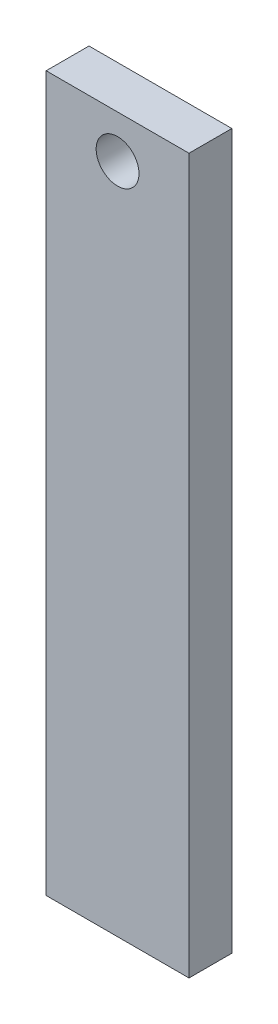
ISO-10303-21;
HEADER;
FILE_DESCRIPTION(('STEP AP214'),'2;1');
FILE_NAME('part.step','',(''),(''),'','','');
FILE_SCHEMA(('AUTOMOTIVE_DESIGN { 1 0 10303 214 1 1 1 1 }'));
ENDSEC;
DATA;
#1=APPLICATION_CONTEXT('core data for automotive mechanical design processes');
#2=APPLICATION_PROTOCOL_DEFINITION('international standard','automotive_design',2000,#1);
#3=PRODUCT_CONTEXT('',#1,'mechanical');
#4=PRODUCT('Part','Part','',(#3));
#5=PRODUCT_RELATED_PRODUCT_CATEGORY('part','',(#4));
#6=PRODUCT_DEFINITION_FORMATION('','',#4);
#7=PRODUCT_DEFINITION_CONTEXT('part definition',#1,'design');
#8=PRODUCT_DEFINITION('design','',#6,#7);
#9=PRODUCT_DEFINITION_SHAPE('','',#8);
#10=(LENGTH_UNIT() NAMED_UNIT(*) SI_UNIT(.MILLI.,.METRE.));
#11=(NAMED_UNIT(*) PLANE_ANGLE_UNIT() SI_UNIT($,.RADIAN.));
#12=(NAMED_UNIT(*) SI_UNIT($,.STERADIAN.) SOLID_ANGLE_UNIT());
#13=UNCERTAINTY_MEASURE_WITH_UNIT(LENGTH_MEASURE(1.E-05),#10,'distance_accuracy_value','');
#14=(GEOMETRIC_REPRESENTATION_CONTEXT(3) GLOBAL_UNCERTAINTY_ASSIGNED_CONTEXT((#13)) GLOBAL_UNIT_ASSIGNED_CONTEXT((#10,
#11,#12)) REPRESENTATION_CONTEXT('',''));
#15=CARTESIAN_POINT('',(0.,0.,0.));
#16=DIRECTION('',(0.,0.,1.));
#17=DIRECTION('',(1.,0.,0.));
#18=AXIS2_PLACEMENT_3D('',#15,#16,#17);
#19=CARTESIAN_POINT('',(25.,250.,-7.5));
#20=DIRECTION('',(-1.,0.,0.));
#21=DIRECTION('',(0.,0.,1.));
#22=AXIS2_PLACEMENT_3D('',#19,#20,#21);
#23=PLANE('',#22);
#24=DIRECTION('',(0.,0.,-1.));
#25=VECTOR('',#24,1.);
#26=CARTESIAN_POINT('',(25.,0.,-7.5));
#27=LINE('',#26,#25);
#28=CARTESIAN_POINT('',(25.,0.,7.5));
#29=VERTEX_POINT('',#28);
#30=CARTESIAN_POINT('',(25.,0.,-7.5));
#31=VERTEX_POINT('',#30);
#32=EDGE_CURVE('E96',#29,#31,#27,.T.);
#33=ORIENTED_EDGE('',*,*,#32,.T.);
#34=DIRECTION('',(0.,-1.,0.));
#35=VECTOR('',#34,1.);
#36=CARTESIAN_POINT('',(25.,250.,-7.5));
#37=LINE('',#36,#35);
#38=CARTESIAN_POINT('',(25.,250.,-7.5));
#39=VERTEX_POINT('',#38);
#40=EDGE_CURVE('E11',#39,#31,#37,.T.);
#41=ORIENTED_EDGE('',*,*,#40,.F.);
#42=DIRECTION('',(0.,0.,-1.));
#43=VECTOR('',#42,1.);
#44=CARTESIAN_POINT('',(25.,250.,-7.5));
#45=LINE('',#44,#43);
#46=CARTESIAN_POINT('',(25.,250.,7.5));
#47=VERTEX_POINT('',#46);
#48=EDGE_CURVE('E84',#47,#39,#45,.T.);
#49=ORIENTED_EDGE('',*,*,#48,.F.);
#50=DIRECTION('',(0.,-1.,0.));
#51=VECTOR('',#50,1.);
#52=CARTESIAN_POINT('',(25.,250.,7.5));
#53=LINE('',#52,#51);
#54=EDGE_CURVE('E92',#47,#29,#53,.T.);
#55=ORIENTED_EDGE('',*,*,#54,.T.);
#56=EDGE_LOOP('',(#33,#41,#49,#55));
#57=FACE_BOUND('',#56,.T.);
#58=ADVANCED_FACE('F33',(#57),#23,.F.);
#59=CARTESIAN_POINT('',(-25.,250.,-7.5));
#60=DIRECTION('',(0.,0.,1.));
#61=DIRECTION('',(1.,0.,0.));
#62=AXIS2_PLACEMENT_3D('',#59,#60,#61);
#63=PLANE('',#62);
#64=CARTESIAN_POINT('',(0.,235.049185274442,-7.5));
#65=DIRECTION('',(0.,0.,1.));
#66=DIRECTION('',(1.,0.,0.));
#67=AXIS2_PLACEMENT_3D('',#64,#65,#66);
#68=CIRCLE('',#67,7.5);
#69=CARTESIAN_POINT('',(7.50000000000001,235.049185274442,-7.5));
#70=VERTEX_POINT('',#69);
#71=EDGE_CURVE('E99',#70,#70,#68,.T.);
#72=ORIENTED_EDGE('',*,*,#71,.T.);
#73=EDGE_LOOP('',(#72));
#74=FACE_BOUND('',#73,.T.);
#75=DIRECTION('',(-1.,0.,0.));
#76=VECTOR('',#75,1.);
#77=CARTESIAN_POINT('',(-25.,0.,-7.5));
#78=LINE('',#77,#76);
#79=CARTESIAN_POINT('',(-25.,0.,-7.5));
#80=VERTEX_POINT('',#79);
#81=EDGE_CURVE('E88',#31,#80,#78,.T.);
#82=ORIENTED_EDGE('',*,*,#81,.T.);
#83=DIRECTION('',(0.,-1.,0.));
#84=VECTOR('',#83,1.);
#85=CARTESIAN_POINT('',(-25.,250.,-7.5));
#86=LINE('',#85,#84);
#87=CARTESIAN_POINT('',(-25.,250.,-7.5));
#88=VERTEX_POINT('',#87);
#89=EDGE_CURVE('E41',#88,#80,#86,.T.);
#90=ORIENTED_EDGE('',*,*,#89,.F.);
#91=DIRECTION('',(-1.,0.,0.));
#92=VECTOR('',#91,1.);
#93=CARTESIAN_POINT('',(-25.,250.,-7.5));
#94=LINE('',#93,#92);
#95=EDGE_CURVE('E79',#39,#88,#94,.T.);
#96=ORIENTED_EDGE('',*,*,#95,.F.);
#97=ORIENTED_EDGE('',*,*,#40,.T.);
#98=EDGE_LOOP('',(#82,#90,#96,#97));
#99=FACE_BOUND('',#98,.T.);
#100=ADVANCED_FACE('F87',(#74,#99),#63,.F.);
#101=CARTESIAN_POINT('',(-25.,250.,-7.5));
#102=DIRECTION('',(1.,0.,0.));
#103=DIRECTION('',(0.,0.,-1.));
#104=AXIS2_PLACEMENT_3D('',#101,#102,#103);
#105=PLANE('',#104);
#106=DIRECTION('',(0.,0.,1.));
#107=VECTOR('',#106,1.);
#108=CARTESIAN_POINT('',(-25.,0.,-7.5));
#109=LINE('',#108,#107);
#110=CARTESIAN_POINT('',(-25.,0.,7.5));
#111=VERTEX_POINT('',#110);
#112=EDGE_CURVE('E66',#80,#111,#109,.T.);
#113=ORIENTED_EDGE('',*,*,#112,.T.);
#114=DIRECTION('',(0.,-1.,0.));
#115=VECTOR('',#114,1.);
#116=CARTESIAN_POINT('',(-25.,250.,7.5));
#117=LINE('',#116,#115);
#118=CARTESIAN_POINT('',(-25.,250.,7.5));
#119=VERTEX_POINT('',#118);
#120=EDGE_CURVE('E89',#119,#111,#117,.T.);
#121=ORIENTED_EDGE('',*,*,#120,.F.);
#122=DIRECTION('',(0.,0.,1.));
#123=VECTOR('',#122,1.);
#124=CARTESIAN_POINT('',(-25.,250.,-7.5));
#125=LINE('',#124,#123);
#126=EDGE_CURVE('E82',#88,#119,#125,.T.);
#127=ORIENTED_EDGE('',*,*,#126,.F.);
#128=ORIENTED_EDGE('',*,*,#89,.T.);
#129=EDGE_LOOP('',(#113,#121,#127,#128));
#130=FACE_BOUND('',#129,.T.);
#131=ADVANCED_FACE('F90',(#130),#105,.F.);
#132=CARTESIAN_POINT('',(-25.,250.,7.5));
#133=DIRECTION('',(0.,0.,-1.));
#134=DIRECTION('',(-1.,0.,0.));
#135=AXIS2_PLACEMENT_3D('',#132,#133,#134);
#136=PLANE('',#135);
#137=CARTESIAN_POINT('',(0.,235.049185274442,7.5));
#138=DIRECTION('',(0.,0.,1.));
#139=DIRECTION('',(1.,0.,0.));
#140=AXIS2_PLACEMENT_3D('',#137,#138,#139);
#141=CIRCLE('',#140,7.5);
#142=CARTESIAN_POINT('',(7.50000000000001,235.049185274442,7.5));
#143=VERTEX_POINT('',#142);
#144=EDGE_CURVE('E110',#143,#143,#141,.T.);
#145=ORIENTED_EDGE('',*,*,#144,.F.);
#146=EDGE_LOOP('',(#145));
#147=FACE_BOUND('',#146,.T.);
#148=DIRECTION('',(1.,0.,0.));
#149=VECTOR('',#148,1.);
#150=CARTESIAN_POINT('',(-25.,0.,7.5));
#151=LINE('',#150,#149);
#152=EDGE_CURVE('E72',#111,#29,#151,.T.);
#153=ORIENTED_EDGE('',*,*,#152,.T.);
#154=ORIENTED_EDGE('',*,*,#54,.F.);
#155=DIRECTION('',(1.,0.,0.));
#156=VECTOR('',#155,1.);
#157=CARTESIAN_POINT('',(-25.,250.,7.5));
#158=LINE('',#157,#156);
#159=EDGE_CURVE('E49',#119,#47,#158,.T.);
#160=ORIENTED_EDGE('',*,*,#159,.F.);
#161=ORIENTED_EDGE('',*,*,#120,.T.);
#162=EDGE_LOOP('',(#153,#154,#160,#161));
#163=FACE_BOUND('',#162,.T.);
#164=ADVANCED_FACE('F104',(#147,#163),#136,.F.);
#165=CARTESIAN_POINT('',(0.,250.,0.));
#166=DIRECTION('',(0.,1.,0.));
#167=DIRECTION('',(0.,0.,1.));
#168=AXIS2_PLACEMENT_3D('',#165,#166,#167);
#169=PLANE('',#168);
#170=ORIENTED_EDGE('',*,*,#48,.T.);
#171=ORIENTED_EDGE('',*,*,#95,.T.);
#172=ORIENTED_EDGE('',*,*,#126,.T.);
#173=ORIENTED_EDGE('',*,*,#159,.T.);
#174=EDGE_LOOP('',(#170,#171,#172,#173));
#175=FACE_BOUND('',#174,.T.);
#176=ADVANCED_FACE('F80',(#175),#169,.T.);
#177=CARTESIAN_POINT('',(0.,0.,0.));
#178=DIRECTION('',(0.,1.,0.));
#179=DIRECTION('',(0.,0.,1.));
#180=AXIS2_PLACEMENT_3D('',#177,#178,#179);
#181=PLANE('',#180);
#182=ORIENTED_EDGE('',*,*,#32,.F.);
#183=ORIENTED_EDGE('',*,*,#152,.F.);
#184=ORIENTED_EDGE('',*,*,#112,.F.);
#185=ORIENTED_EDGE('',*,*,#81,.F.);
#186=EDGE_LOOP('',(#182,#183,#184,#185));
#187=FACE_BOUND('',#186,.T.);
#188=ADVANCED_FACE('F107',(#187),#181,.F.);
#189=CARTESIAN_POINT('',(0.,235.049185274442,-7.5));
#190=DIRECTION('',(0.,0.,1.));
#191=DIRECTION('',(1.,0.,0.));
#192=AXIS2_PLACEMENT_3D('',#189,#190,#191);
#193=CYLINDRICAL_SURFACE('',#192,7.5);
#194=ORIENTED_EDGE('',*,*,#71,.F.);
#195=EDGE_LOOP('',(#194));
#196=FACE_BOUND('',#195,.T.);
#197=ORIENTED_EDGE('',*,*,#144,.T.);
#198=EDGE_LOOP('',(#197));
#199=FACE_BOUND('',#198,.T.);
#200=ADVANCED_FACE('F117',(#196,#199),#193,.F.);
#201=CLOSED_SHELL('',(#58,#100,#131,#164,#176,#188,#200));
#202=MANIFOLD_SOLID_BREP('B2',#201);
#203=ADVANCED_BREP_SHAPE_REPRESENTATION('',(#18,#202),#14);
#204=SHAPE_DEFINITION_REPRESENTATION(#9,#203);
ENDSEC;
END-ISO-10303-21;
